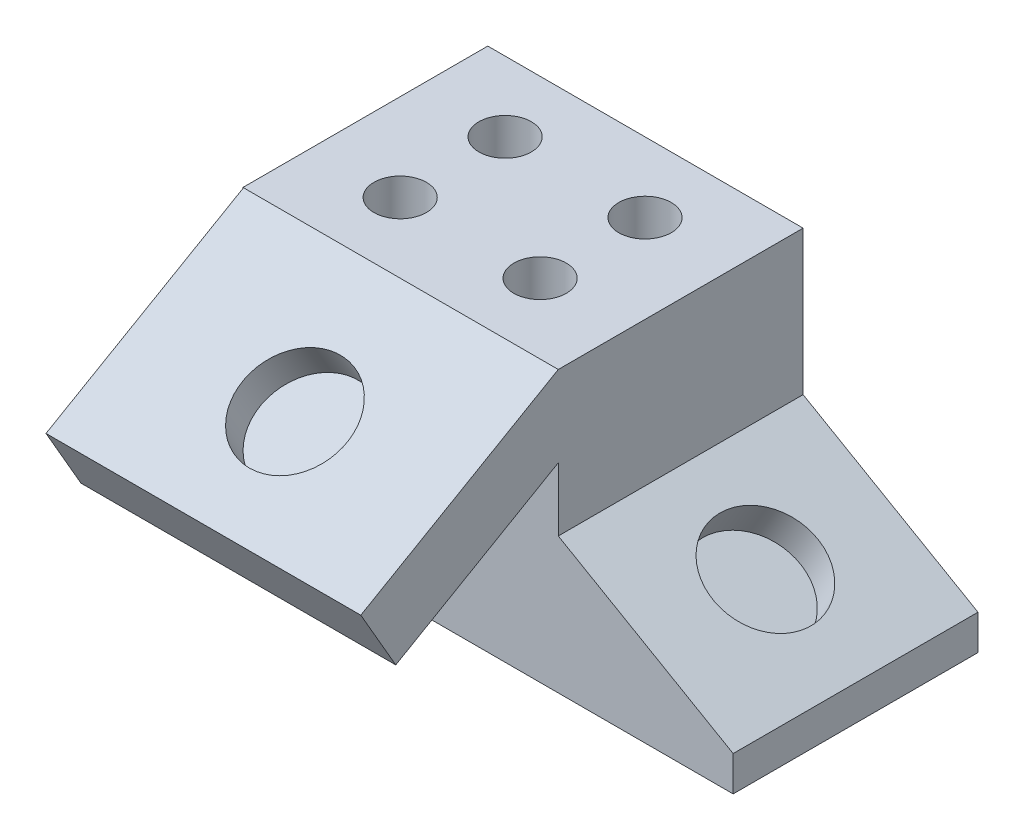
ISO-10303-21;
HEADER;
FILE_DESCRIPTION(('STEP AP214'),'2;1');
FILE_NAME('part.step','',(''),(''),'','','');
FILE_SCHEMA(('AUTOMOTIVE_DESIGN { 1 0 10303 214 1 1 1 1 }'));
ENDSEC;
DATA;
#1=APPLICATION_CONTEXT('core data for automotive mechanical design processes');
#2=APPLICATION_PROTOCOL_DEFINITION('international standard','automotive_design',2000,#1);
#3=PRODUCT_CONTEXT('',#1,'mechanical');
#4=PRODUCT('Part','Part','',(#3));
#5=PRODUCT_RELATED_PRODUCT_CATEGORY('part','',(#4));
#6=PRODUCT_DEFINITION_FORMATION('','',#4);
#7=PRODUCT_DEFINITION_CONTEXT('part definition',#1,'design');
#8=PRODUCT_DEFINITION('design','',#6,#7);
#9=PRODUCT_DEFINITION_SHAPE('','',#8);
#10=(LENGTH_UNIT() NAMED_UNIT(*) SI_UNIT(.MILLI.,.METRE.));
#11=(NAMED_UNIT(*) PLANE_ANGLE_UNIT() SI_UNIT($,.RADIAN.));
#12=(NAMED_UNIT(*) SI_UNIT($,.STERADIAN.) SOLID_ANGLE_UNIT());
#13=UNCERTAINTY_MEASURE_WITH_UNIT(LENGTH_MEASURE(1.E-05),#10,'distance_accuracy_value','');
#14=(GEOMETRIC_REPRESENTATION_CONTEXT(3) GLOBAL_UNCERTAINTY_ASSIGNED_CONTEXT((#13)) GLOBAL_UNIT_ASSIGNED_CONTEXT((#10,
#11,#12)) REPRESENTATION_CONTEXT('',''));
#15=CARTESIAN_POINT('',(0.,0.,0.));
#16=DIRECTION('',(0.,0.,1.));
#17=DIRECTION('',(1.,0.,0.));
#18=AXIS2_PLACEMENT_3D('',#15,#16,#17);
#19=CARTESIAN_POINT('',(0.,0.,44.45));
#20=DIRECTION('',(0.,0.,-1.));
#21=DIRECTION('',(-1.,0.,0.));
#22=AXIS2_PLACEMENT_3D('',#19,#20,#21);
#23=PLANE('',#22);
#24=DIRECTION('',(1.,0.,0.));
#25=VECTOR('',#24,1.);
#26=CARTESIAN_POINT('',(0.0989276974731404,36.1977904066003,44.45));
#27=LINE('',#26,#25);
#28=CARTESIAN_POINT('',(0.0989276974731404,36.1977904066003,44.45));
#29=VERTEX_POINT('',#28);
#30=CARTESIAN_POINT('',(57.2489276974731,36.1977904066003,44.45));
#31=VERTEX_POINT('',#30);
#32=EDGE_CURVE('E138',#29,#31,#27,.T.);
#33=ORIENTED_EDGE('',*,*,#32,.F.);
#34=DIRECTION('',(0.,1.,0.));
#35=VECTOR('',#34,1.);
#36=CARTESIAN_POINT('',(0.0989276974731404,50.8624872440168,44.45));
#37=LINE('',#36,#35);
#38=CARTESIAN_POINT('',(0.0989276974731404,50.8624872440168,44.45));
#39=VERTEX_POINT('',#38);
#40=EDGE_CURVE('E172',#29,#39,#37,.T.);
#41=ORIENTED_EDGE('',*,*,#40,.T.);
#42=DIRECTION('',(-1.,0.,0.));
#43=VECTOR('',#42,1.);
#44=CARTESIAN_POINT('',(0.,50.8624872440168,44.45));
#45=LINE('',#44,#43);
#46=CARTESIAN_POINT('',(0.,50.8624872440168,44.45));
#47=VERTEX_POINT('',#46);
#48=EDGE_CURVE('E126',#39,#47,#45,.T.);
#49=ORIENTED_EDGE('',*,*,#48,.T.);
#50=DIRECTION('',(0.,-1.,0.));
#51=VECTOR('',#50,1.);
#52=CARTESIAN_POINT('',(0.,0.,44.45));
#53=LINE('',#52,#51);
#54=CARTESIAN_POINT('',(0.,0.,44.45));
#55=VERTEX_POINT('',#54);
#56=EDGE_CURVE('E61',#47,#55,#53,.T.);
#57=ORIENTED_EDGE('',*,*,#56,.T.);
#58=DIRECTION('',(1.,0.,0.));
#59=VECTOR('',#58,1.);
#60=CARTESIAN_POINT('',(88.9989276974731,0.,44.45));
#61=LINE('',#60,#59);
#62=CARTESIAN_POINT('',(88.9989276974731,0.,44.45));
#63=VERTEX_POINT('',#62);
#64=EDGE_CURVE('E146',#55,#63,#61,.T.);
#65=ORIENTED_EDGE('',*,*,#64,.T.);
#66=DIRECTION('',(0.,1.,0.));
#67=VECTOR('',#66,1.);
#68=CARTESIAN_POINT('',(88.9989276974731,6.35,44.45));
#69=LINE('',#68,#67);
#70=CARTESIAN_POINT('',(88.9989276974731,6.35,44.45));
#71=VERTEX_POINT('',#70);
#72=EDGE_CURVE('E96',#63,#71,#69,.T.);
#73=ORIENTED_EDGE('',*,*,#72,.T.);
#74=DIRECTION('',(-0.86602540378444,0.499999999999998,0.));
#75=VECTOR('',#74,1.);
#76=CARTESIAN_POINT('',(57.2489276974731,24.6808710467705,44.45));
#77=LINE('',#76,#75);
#78=CARTESIAN_POINT('',(57.2489276974731,24.6808710467705,44.45));
#79=VERTEX_POINT('',#78);
#80=EDGE_CURVE('E104',#71,#79,#77,.T.);
#81=ORIENTED_EDGE('',*,*,#80,.T.);
#82=DIRECTION('',(0.,1.,0.));
#83=VECTOR('',#82,1.);
#84=CARTESIAN_POINT('',(57.2489276974731,50.8624872440168,44.45));
#85=LINE('',#84,#83);
#86=EDGE_CURVE('E108',#79,#31,#85,.T.);
#87=ORIENTED_EDGE('',*,*,#86,.T.);
#88=EDGE_LOOP('',(#33,#41,#49,#57,#65,#73,#81,#87));
#89=FACE_BOUND('',#88,.T.);
#90=ADVANCED_FACE('F37',(#89),#23,.F.);
#91=CARTESIAN_POINT('',(88.9989276974731,0.,44.45));
#92=DIRECTION('',(0.,1.,0.));
#93=DIRECTION('',(-1.,0.,0.));
#94=AXIS2_PLACEMENT_3D('',#91,#92,#93);
#95=PLANE('',#94);
#96=DIRECTION('',(1.,0.,0.));
#97=VECTOR('',#96,1.);
#98=CARTESIAN_POINT('',(88.9989276974731,0.,0.));
#99=LINE('',#98,#97);
#100=CARTESIAN_POINT('',(0.,0.,0.));
#101=VERTEX_POINT('',#100);
#102=CARTESIAN_POINT('',(88.9989276974731,0.,0.));
#103=VERTEX_POINT('',#102);
#104=EDGE_CURVE('E134',#101,#103,#99,.T.);
#105=ORIENTED_EDGE('',*,*,#104,.T.);
#106=DIRECTION('',(0.,0.,-1.));
#107=VECTOR('',#106,1.);
#108=CARTESIAN_POINT('',(88.9989276974731,0.,44.45));
#109=LINE('',#108,#107);
#110=EDGE_CURVE('E11',#63,#103,#109,.T.);
#111=ORIENTED_EDGE('',*,*,#110,.F.);
#112=ORIENTED_EDGE('',*,*,#64,.F.);
#113=DIRECTION('',(0.,0.,-1.));
#114=VECTOR('',#113,1.);
#115=CARTESIAN_POINT('',(0.,0.,44.45));
#116=LINE('',#115,#114);
#117=EDGE_CURVE('E133',#55,#101,#116,.T.);
#118=ORIENTED_EDGE('',*,*,#117,.T.);
#119=EDGE_LOOP('',(#105,#111,#112,#118));
#120=FACE_BOUND('',#119,.T.);
#121=ADVANCED_FACE('F39',(#120),#95,.F.);
#122=CARTESIAN_POINT('',(88.9989276974731,6.35,44.45));
#123=DIRECTION('',(-1.,0.,0.));
#124=DIRECTION('',(0.,0.,1.));
#125=AXIS2_PLACEMENT_3D('',#122,#123,#124);
#126=PLANE('',#125);
#127=DIRECTION('',(0.,1.,0.));
#128=VECTOR('',#127,1.);
#129=CARTESIAN_POINT('',(88.9989276974731,6.35,0.));
#130=LINE('',#129,#128);
#131=CARTESIAN_POINT('',(88.9989276974731,6.35,0.));
#132=VERTEX_POINT('',#131);
#133=EDGE_CURVE('E137',#103,#132,#130,.T.);
#134=ORIENTED_EDGE('',*,*,#133,.T.);
#135=DIRECTION('',(0.,0.,-1.));
#136=VECTOR('',#135,1.);
#137=CARTESIAN_POINT('',(88.9989276974731,6.35,44.45));
#138=LINE('',#137,#136);
#139=EDGE_CURVE('E45',#71,#132,#138,.T.);
#140=ORIENTED_EDGE('',*,*,#139,.F.);
#141=ORIENTED_EDGE('',*,*,#72,.F.);
#142=ORIENTED_EDGE('',*,*,#110,.T.);
#143=EDGE_LOOP('',(#134,#140,#141,#142));
#144=FACE_BOUND('',#143,.T.);
#145=ADVANCED_FACE('F201',(#144),#126,.F.);
#146=CARTESIAN_POINT('',(57.2489276974731,24.6808710467705,44.45));
#147=DIRECTION('',(-0.499999999999998,-0.86602540378444,0.));
#148=DIRECTION('',(0.86602540378444,-0.499999999999998,0.));
#149=AXIS2_PLACEMENT_3D('',#146,#147,#148);
#150=PLANE('',#149);
#151=CARTESIAN_POINT('',(72.5011437553796,15.8749999999999,22.098));
#152=DIRECTION('',(0.499999999999998,0.86602540378444,0.));
#153=DIRECTION('',(-0.86602540378444,0.499999999999998,0.));
#154=AXIS2_PLACEMENT_3D('',#151,#152,#153);
#155=CIRCLE('',#154,9.52500000000002);
#156=CARTESIAN_POINT('',(64.2522517843328,20.6374999999999,22.098));
#157=VERTEX_POINT('',#156);
#158=EDGE_CURVE('E444',#157,#157,#155,.T.);
#159=ORIENTED_EDGE('',*,*,#158,.F.);
#160=EDGE_LOOP('',(#159));
#161=FACE_BOUND('',#160,.T.);
#162=DIRECTION('',(-0.86602540378444,0.499999999999998,0.));
#163=VECTOR('',#162,1.);
#164=CARTESIAN_POINT('',(57.2489276974731,24.6808710467705,0.));
#165=LINE('',#164,#163);
#166=CARTESIAN_POINT('',(57.2489276974731,24.6808710467705,0.));
#167=VERTEX_POINT('',#166);
#168=EDGE_CURVE('E116',#132,#167,#165,.T.);
#169=ORIENTED_EDGE('',*,*,#168,.T.);
#170=DIRECTION('',(0.,0.,-1.));
#171=VECTOR('',#170,1.);
#172=CARTESIAN_POINT('',(57.2489276974731,24.6808710467705,44.45));
#173=LINE('',#172,#171);
#174=EDGE_CURVE('E113',#79,#167,#173,.T.);
#175=ORIENTED_EDGE('',*,*,#174,.F.);
#176=ORIENTED_EDGE('',*,*,#80,.F.);
#177=ORIENTED_EDGE('',*,*,#139,.T.);
#178=EDGE_LOOP('',(#169,#175,#176,#177));
#179=FACE_BOUND('',#178,.T.);
#180=ADVANCED_FACE('F114',(#161,#179),#150,.F.);
#181=CARTESIAN_POINT('',(57.2489276974731,50.8624872440168,44.45));
#182=DIRECTION('',(-1.,0.,0.));
#183=DIRECTION('',(0.,0.,1.));
#184=AXIS2_PLACEMENT_3D('',#181,#182,#183);
#185=PLANE('',#184);
#186=DIRECTION('',(0.,1.,0.));
#187=VECTOR('',#186,1.);
#188=CARTESIAN_POINT('',(57.2489276974731,50.8624872440168,0.));
#189=LINE('',#188,#187);
#190=CARTESIAN_POINT('',(57.2489276974731,50.8624872440168,0.));
#191=VERTEX_POINT('',#190);
#192=EDGE_CURVE('E141',#167,#191,#189,.T.);
#193=ORIENTED_EDGE('',*,*,#192,.T.);
#194=DIRECTION('',(0.,0.,-1.));
#195=VECTOR('',#194,1.);
#196=CARTESIAN_POINT('',(57.2489276974731,50.8624872440168,44.45));
#197=LINE('',#196,#195);
#198=CARTESIAN_POINT('',(57.2489276974731,50.8624872440168,44.45));
#199=VERTEX_POINT('',#198);
#200=EDGE_CURVE('E119',#199,#191,#197,.T.);
#201=ORIENTED_EDGE('',*,*,#200,.F.);
#202=DIRECTION('',(0.,-0.499999999999995,0.866025403784441));
#203=VECTOR('',#202,1.);
#204=CARTESIAN_POINT('',(57.2489276974731,50.8624872440168,44.45));
#205=LINE('',#204,#203);
#206=CARTESIAN_POINT('',(57.2489276974731,30.161487244017,80.3051837674834));
#207=VERTEX_POINT('',#206);
#208=EDGE_CURVE('E171',#199,#207,#205,.T.);
#209=ORIENTED_EDGE('',*,*,#208,.T.);
#210=DIRECTION('',(0.,-0.866025403784441,-0.499999999999995));
#211=VECTOR('',#210,1.);
#212=CARTESIAN_POINT('',(57.2489276974731,30.161487244017,80.3051837674834));
#213=LINE('',#212,#211);
#214=CARTESIAN_POINT('',(57.2489276974731,19.1629646159546,73.9551837674835));
#215=VERTEX_POINT('',#214);
#216=EDGE_CURVE('E179',#207,#215,#213,.T.);
#217=ORIENTED_EDGE('',*,*,#216,.T.);
#218=DIRECTION('',(0.,0.499999999999995,-0.866025403784441));
#219=VECTOR('',#218,1.);
#220=CARTESIAN_POINT('',(57.2489276974731,19.1629646159546,73.9551837674835));
#221=LINE('',#220,#219);
#222=EDGE_CURVE('E125',#215,#31,#221,.T.);
#223=ORIENTED_EDGE('',*,*,#222,.T.);
#224=ORIENTED_EDGE('',*,*,#86,.F.);
#225=ORIENTED_EDGE('',*,*,#174,.T.);
#226=EDGE_LOOP('',(#193,#201,#209,#217,#223,#224,#225));
#227=FACE_BOUND('',#226,.T.);
#228=ADVANCED_FACE('F122',(#227),#185,.F.);
#229=CARTESIAN_POINT('',(0.,50.8624872440168,44.45));
#230=DIRECTION('',(0.,-1.,0.));
#231=DIRECTION('',(0.,0.,-1.));
#232=AXIS2_PLACEMENT_3D('',#229,#230,#231);
#233=PLANE('',#232);
#234=CARTESIAN_POINT('',(41.2469276974731,50.8624872440168,12.7));
#235=DIRECTION('',(0.,1.,0.));
#236=DIRECTION('',(0.,0.,1.));
#237=AXIS2_PLACEMENT_3D('',#234,#235,#236);
#238=CIRCLE('',#237,4.7625);
#239=CARTESIAN_POINT('',(41.2469276974731,50.8624872440168,17.4625));
#240=VERTEX_POINT('',#239);
#241=EDGE_CURVE('E432',#240,#240,#238,.T.);
#242=ORIENTED_EDGE('',*,*,#241,.F.);
#243=EDGE_LOOP('',(#242));
#244=FACE_BOUND('',#243,.T.);
#245=CARTESIAN_POINT('',(41.2469276974731,50.8624872440168,31.75));
#246=DIRECTION('',(0.,1.,0.));
#247=DIRECTION('',(0.,0.,1.));
#248=AXIS2_PLACEMENT_3D('',#245,#246,#247);
#249=CIRCLE('',#248,4.7625);
#250=CARTESIAN_POINT('',(41.2469276974731,50.8624872440168,36.5125));
#251=VERTEX_POINT('',#250);
#252=EDGE_CURVE('E431',#251,#251,#249,.T.);
#253=ORIENTED_EDGE('',*,*,#252,.F.);
#254=EDGE_LOOP('',(#253));
#255=FACE_BOUND('',#254,.T.);
#256=CARTESIAN_POINT('',(15.8469276974731,50.8624872440168,31.75));
#257=DIRECTION('',(0.,1.,0.));
#258=DIRECTION('',(0.,0.,1.));
#259=AXIS2_PLACEMENT_3D('',#256,#257,#258);
#260=CIRCLE('',#259,4.7625);
#261=CARTESIAN_POINT('',(15.8469276974731,50.8624872440168,36.5125));
#262=VERTEX_POINT('',#261);
#263=EDGE_CURVE('E464',#262,#262,#260,.T.);
#264=ORIENTED_EDGE('',*,*,#263,.F.);
#265=EDGE_LOOP('',(#264));
#266=FACE_BOUND('',#265,.T.);
#267=CARTESIAN_POINT('',(15.8469276974731,50.8624872440168,12.7));
#268=DIRECTION('',(0.,1.,0.));
#269=DIRECTION('',(0.,0.,1.));
#270=AXIS2_PLACEMENT_3D('',#267,#268,#269);
#271=CIRCLE('',#270,4.7625);
#272=CARTESIAN_POINT('',(15.8469276974731,50.8624872440168,17.4625));
#273=VERTEX_POINT('',#272);
#274=EDGE_CURVE('E445',#273,#273,#271,.T.);
#275=ORIENTED_EDGE('',*,*,#274,.F.);
#276=EDGE_LOOP('',(#275));
#277=FACE_BOUND('',#276,.T.);
#278=DIRECTION('',(-1.,0.,0.));
#279=VECTOR('',#278,1.);
#280=CARTESIAN_POINT('',(0.,50.8624872440168,0.));
#281=LINE('',#280,#279);
#282=CARTESIAN_POINT('',(0.,50.8624872440168,0.));
#283=VERTEX_POINT('',#282);
#284=EDGE_CURVE('E143',#191,#283,#281,.T.);
#285=ORIENTED_EDGE('',*,*,#284,.T.);
#286=DIRECTION('',(0.,0.,-1.));
#287=VECTOR('',#286,1.);
#288=CARTESIAN_POINT('',(0.,50.8624872440168,44.45));
#289=LINE('',#288,#287);
#290=EDGE_CURVE('E148',#47,#283,#289,.T.);
#291=ORIENTED_EDGE('',*,*,#290,.F.);
#292=ORIENTED_EDGE('',*,*,#48,.F.);
#293=EDGE_CURVE('E128',#199,#39,#45,.T.);
#294=ORIENTED_EDGE('',*,*,#293,.F.);
#295=ORIENTED_EDGE('',*,*,#200,.T.);
#296=EDGE_LOOP('',(#285,#291,#292,#294,#295));
#297=FACE_BOUND('',#296,.T.);
#298=ADVANCED_FACE('F160',(#244,#255,#266,#277,#297),#233,.F.);
#299=CARTESIAN_POINT('',(0.,0.,44.45));
#300=DIRECTION('',(1.,0.,0.));
#301=DIRECTION('',(0.,0.,-1.));
#302=AXIS2_PLACEMENT_3D('',#299,#300,#301);
#303=PLANE('',#302);
#304=DIRECTION('',(0.,-1.,0.));
#305=VECTOR('',#304,1.);
#306=CARTESIAN_POINT('',(0.,0.,0.));
#307=LINE('',#306,#305);
#308=EDGE_CURVE('E88',#283,#101,#307,.T.);
#309=ORIENTED_EDGE('',*,*,#308,.T.);
#310=ORIENTED_EDGE('',*,*,#117,.F.);
#311=ORIENTED_EDGE('',*,*,#56,.F.);
#312=ORIENTED_EDGE('',*,*,#290,.T.);
#313=EDGE_LOOP('',(#309,#310,#311,#312));
#314=FACE_BOUND('',#313,.T.);
#315=ADVANCED_FACE('F219',(#314),#303,.F.);
#316=CARTESIAN_POINT('',(0.,0.,0.));
#317=DIRECTION('',(0.,0.,-1.));
#318=DIRECTION('',(-1.,0.,0.));
#319=AXIS2_PLACEMENT_3D('',#316,#317,#318);
#320=PLANE('',#319);
#321=ORIENTED_EDGE('',*,*,#104,.F.);
#322=ORIENTED_EDGE('',*,*,#308,.F.);
#323=ORIENTED_EDGE('',*,*,#284,.F.);
#324=ORIENTED_EDGE('',*,*,#192,.F.);
#325=ORIENTED_EDGE('',*,*,#168,.F.);
#326=ORIENTED_EDGE('',*,*,#133,.F.);
#327=EDGE_LOOP('',(#321,#322,#323,#324,#325,#326));
#328=FACE_BOUND('',#327,.T.);
#329=ADVANCED_FACE('F153',(#328),#320,.T.);
#330=CARTESIAN_POINT('',(0.0989276974731404,19.1629646159546,73.9551837674835));
#331=DIRECTION('',(0.,-0.866025403784441,-0.499999999999995));
#332=DIRECTION('',(0.,0.499999999999995,-0.866025403784441));
#333=AXIS2_PLACEMENT_3D('',#330,#331,#332);
#334=PLANE('',#333);
#335=ORIENTED_EDGE('',*,*,#222,.F.);
#336=DIRECTION('',(1.,0.,0.));
#337=VECTOR('',#336,1.);
#338=CARTESIAN_POINT('',(0.0989276974731404,19.1629646159546,73.9551837674835));
#339=LINE('',#338,#337);
#340=CARTESIAN_POINT('',(0.0989276974731404,19.1629646159546,73.9551837674835));
#341=VERTEX_POINT('',#340);
#342=EDGE_CURVE('E194',#341,#215,#339,.T.);
#343=ORIENTED_EDGE('',*,*,#342,.F.);
#344=DIRECTION('',(0.,0.499999999999995,-0.866025403784441));
#345=VECTOR('',#344,1.);
#346=CARTESIAN_POINT('',(0.0989276974731404,19.1629646159546,73.9551837674835));
#347=LINE('',#346,#345);
#348=EDGE_CURVE('E187',#341,#29,#347,.T.);
#349=ORIENTED_EDGE('',*,*,#348,.T.);
#350=ORIENTED_EDGE('',*,*,#32,.T.);
#351=EDGE_LOOP('',(#335,#343,#349,#350));
#352=FACE_BOUND('',#351,.T.);
#353=ADVANCED_FACE('F218',(#352),#334,.T.);
#354=CARTESIAN_POINT('',(0.0989276974731404,30.161487244017,80.3051837674834));
#355=DIRECTION('',(0.,-0.499999999999995,0.866025403784441));
#356=DIRECTION('',(0.,-0.866025403784441,-0.499999999999995));
#357=AXIS2_PLACEMENT_3D('',#354,#355,#356);
#358=PLANE('',#357);
#359=ORIENTED_EDGE('',*,*,#216,.F.);
#360=DIRECTION('',(1.,0.,0.));
#361=VECTOR('',#360,1.);
#362=CARTESIAN_POINT('',(0.0989276974731404,30.161487244017,80.3051837674834));
#363=LINE('',#362,#361);
#364=CARTESIAN_POINT('',(0.0989276974731404,30.161487244017,80.3051837674834));
#365=VERTEX_POINT('',#364);
#366=EDGE_CURVE('E189',#365,#207,#363,.T.);
#367=ORIENTED_EDGE('',*,*,#366,.F.);
#368=DIRECTION('',(0.,-0.866025403784441,-0.499999999999995));
#369=VECTOR('',#368,1.);
#370=CARTESIAN_POINT('',(0.0989276974731404,30.161487244017,80.3051837674834));
#371=LINE('',#370,#369);
#372=EDGE_CURVE('E177',#365,#341,#371,.T.);
#373=ORIENTED_EDGE('',*,*,#372,.T.);
#374=ORIENTED_EDGE('',*,*,#342,.T.);
#375=EDGE_LOOP('',(#359,#367,#373,#374));
#376=FACE_BOUND('',#375,.T.);
#377=ADVANCED_FACE('F250',(#376),#358,.T.);
#378=CARTESIAN_POINT('',(0.0989276974731404,50.8624872440168,44.45));
#379=DIRECTION('',(0.,0.866025403784442,0.499999999999995));
#380=DIRECTION('',(0.,-0.499999999999995,0.866025403784442));
#381=AXIS2_PLACEMENT_3D('',#378,#379,#380);
#382=PLANE('',#381);
#383=CARTESIAN_POINT('',(28.8009276974731,39.6864872440169,63.8073998253899));
#384=DIRECTION('',(0.,0.866025403784442,0.499999999999995));
#385=DIRECTION('',(0.,-0.499999999999995,0.866025403784442));
#386=AXIS2_PLACEMENT_3D('',#383,#384,#385);
#387=CIRCLE('',#386,9.525);
#388=CARTESIAN_POINT('',(28.8009276974731,34.9239872440169,72.0562917964367));
#389=VERTEX_POINT('',#388);
#390=EDGE_CURVE('E182',#389,#389,#387,.T.);
#391=ORIENTED_EDGE('',*,*,#390,.F.);
#392=EDGE_LOOP('',(#391));
#393=FACE_BOUND('',#392,.T.);
#394=ORIENTED_EDGE('',*,*,#208,.F.);
#395=ORIENTED_EDGE('',*,*,#293,.T.);
#396=DIRECTION('',(0.,-0.499999999999995,0.866025403784441));
#397=VECTOR('',#396,1.);
#398=CARTESIAN_POINT('',(0.0989276974731404,50.8624872440168,44.45));
#399=LINE('',#398,#397);
#400=EDGE_CURVE('E52',#39,#365,#399,.T.);
#401=ORIENTED_EDGE('',*,*,#400,.T.);
#402=ORIENTED_EDGE('',*,*,#366,.T.);
#403=EDGE_LOOP('',(#394,#395,#401,#402));
#404=FACE_BOUND('',#403,.T.);
#405=ADVANCED_FACE('F168',(#393,#404),#382,.T.);
#406=CARTESIAN_POINT('',(0.0989276974731404,0.,0.));
#407=DIRECTION('',(1.,0.,0.));
#408=DIRECTION('',(0.,0.,-1.));
#409=AXIS2_PLACEMENT_3D('',#406,#407,#408);
#410=PLANE('',#409);
#411=ORIENTED_EDGE('',*,*,#40,.F.);
#412=ORIENTED_EDGE('',*,*,#348,.F.);
#413=ORIENTED_EDGE('',*,*,#372,.F.);
#414=ORIENTED_EDGE('',*,*,#400,.F.);
#415=EDGE_LOOP('',(#411,#412,#413,#414));
#416=FACE_BOUND('',#415,.T.);
#417=ADVANCED_FACE('F265',(#416),#410,.F.);
#418=CARTESIAN_POINT('',(28.8009276974731,34.1872259299857,60.6323998253899));
#419=DIRECTION('',(0.,0.866025403784442,0.499999999999995));
#420=DIRECTION('',(0.,-0.499999999999995,0.866025403784442));
#421=AXIS2_PLACEMENT_3D('',#418,#419,#420);
#422=CYLINDRICAL_SURFACE('',#421,9.525);
#423=CARTESIAN_POINT('',(28.8009276974731,34.1872259299857,60.6323998253899));
#424=DIRECTION('',(0.,0.866025403784442,0.499999999999995));
#425=DIRECTION('',(0.,-0.499999999999995,0.866025403784442));
#426=AXIS2_PLACEMENT_3D('',#423,#424,#425);
#427=CIRCLE('',#426,9.525);
#428=CARTESIAN_POINT('',(28.8009276974731,29.4247259299857,68.8812917964367));
#429=VERTEX_POINT('',#428);
#430=EDGE_CURVE('E191',#429,#429,#427,.T.);
#431=ORIENTED_EDGE('',*,*,#430,.F.);
#432=EDGE_LOOP('',(#431));
#433=FACE_BOUND('',#432,.T.);
#434=ORIENTED_EDGE('',*,*,#390,.T.);
#435=EDGE_LOOP('',(#434));
#436=FACE_BOUND('',#435,.T.);
#437=ADVANCED_FACE('F272',(#433,#436),#422,.F.);
#438=CARTESIAN_POINT('',(28.8009276974731,34.1872259299857,60.6323998253899));
#439=DIRECTION('',(0.,0.866025403784442,0.499999999999995));
#440=DIRECTION('',(0.,-0.499999999999995,0.866025403784442));
#441=AXIS2_PLACEMENT_3D('',#438,#439,#440);
#442=PLANE('',#441);
#443=ORIENTED_EDGE('',*,*,#430,.T.);
#444=EDGE_LOOP('',(#443));
#445=FACE_BOUND('',#444,.T.);
#446=ADVANCED_FACE('F278',(#445),#442,.T.);
#447=CARTESIAN_POINT('',(69.3261437553796,10.3757386859688,22.098));
#448=DIRECTION('',(0.499999999999998,0.86602540378444,0.));
#449=DIRECTION('',(-0.86602540378444,0.499999999999998,0.));
#450=AXIS2_PLACEMENT_3D('',#447,#448,#449);
#451=CYLINDRICAL_SURFACE('',#450,9.52500000000002);
#452=CARTESIAN_POINT('',(69.3261437553796,10.3757386859688,22.098));
#453=DIRECTION('',(0.499999999999998,0.86602540378444,0.));
#454=DIRECTION('',(-0.86602540378444,0.499999999999998,0.));
#455=AXIS2_PLACEMENT_3D('',#452,#453,#454);
#456=CIRCLE('',#455,9.52500000000002);
#457=CARTESIAN_POINT('',(61.0772517843328,15.1382386859687,22.098));
#458=VERTEX_POINT('',#457);
#459=EDGE_CURVE('E449',#458,#458,#456,.T.);
#460=ORIENTED_EDGE('',*,*,#459,.F.);
#461=EDGE_LOOP('',(#460));
#462=FACE_BOUND('',#461,.T.);
#463=ORIENTED_EDGE('',*,*,#158,.T.);
#464=EDGE_LOOP('',(#463));
#465=FACE_BOUND('',#464,.T.);
#466=ADVANCED_FACE('F286',(#462,#465),#451,.F.);
#467=CARTESIAN_POINT('',(69.3261437553796,10.3757386859688,22.098));
#468=DIRECTION('',(0.499999999999998,0.86602540378444,0.));
#469=DIRECTION('',(-0.86602540378444,0.499999999999998,0.));
#470=AXIS2_PLACEMENT_3D('',#467,#468,#469);
#471=PLANE('',#470);
#472=ORIENTED_EDGE('',*,*,#459,.T.);
#473=EDGE_LOOP('',(#472));
#474=FACE_BOUND('',#473,.T.);
#475=ADVANCED_FACE('F294',(#474),#471,.T.);
#476=CARTESIAN_POINT('',(15.8469276974731,38.1624872440168,12.7));
#477=DIRECTION('',(0.,1.,0.));
#478=DIRECTION('',(0.,0.,1.));
#479=AXIS2_PLACEMENT_3D('',#476,#477,#478);
#480=CYLINDRICAL_SURFACE('',#479,4.7625);
#481=CARTESIAN_POINT('',(15.8469276974731,38.1624872440168,12.7));
#482=DIRECTION('',(0.,1.,0.));
#483=DIRECTION('',(0.,0.,1.));
#484=AXIS2_PLACEMENT_3D('',#481,#482,#483);
#485=CIRCLE('',#484,4.7625);
#486=CARTESIAN_POINT('',(15.8469276974731,38.1624872440168,17.4625));
#487=VERTEX_POINT('',#486);
#488=EDGE_CURVE('E441',#487,#487,#485,.T.);
#489=ORIENTED_EDGE('',*,*,#488,.F.);
#490=EDGE_LOOP('',(#489));
#491=FACE_BOUND('',#490,.T.);
#492=ORIENTED_EDGE('',*,*,#274,.T.);
#493=EDGE_LOOP('',(#492));
#494=FACE_BOUND('',#493,.T.);
#495=ADVANCED_FACE('F301',(#491,#494),#480,.F.);
#496=CARTESIAN_POINT('',(15.8469276974731,38.1624872440168,12.7));
#497=DIRECTION('',(0.,1.,0.));
#498=DIRECTION('',(0.,0.,1.));
#499=AXIS2_PLACEMENT_3D('',#496,#497,#498);
#500=PLANE('',#499);
#501=ORIENTED_EDGE('',*,*,#488,.T.);
#502=EDGE_LOOP('',(#501));
#503=FACE_BOUND('',#502,.T.);
#504=ADVANCED_FACE('F308',(#503),#500,.T.);
#505=CARTESIAN_POINT('',(15.8469276974731,38.1624872440168,31.75));
#506=DIRECTION('',(0.,1.,0.));
#507=DIRECTION('',(0.,0.,1.));
#508=AXIS2_PLACEMENT_3D('',#505,#506,#507);
#509=CYLINDRICAL_SURFACE('',#508,4.7625);
#510=CARTESIAN_POINT('',(15.8469276974731,38.1624872440168,31.75));
#511=DIRECTION('',(0.,1.,0.));
#512=DIRECTION('',(0.,0.,1.));
#513=AXIS2_PLACEMENT_3D('',#510,#511,#512);
#514=CIRCLE('',#513,4.7625);
#515=CARTESIAN_POINT('',(15.8469276974731,38.1624872440168,36.5125));
#516=VERTEX_POINT('',#515);
#517=EDGE_CURVE('E448',#516,#516,#514,.T.);
#518=ORIENTED_EDGE('',*,*,#517,.F.);
#519=EDGE_LOOP('',(#518));
#520=FACE_BOUND('',#519,.T.);
#521=ORIENTED_EDGE('',*,*,#263,.T.);
#522=EDGE_LOOP('',(#521));
#523=FACE_BOUND('',#522,.T.);
#524=ADVANCED_FACE('F316',(#520,#523),#509,.F.);
#525=CARTESIAN_POINT('',(15.8469276974731,38.1624872440168,31.75));
#526=DIRECTION('',(0.,1.,0.));
#527=DIRECTION('',(0.,0.,1.));
#528=AXIS2_PLACEMENT_3D('',#525,#526,#527);
#529=PLANE('',#528);
#530=ORIENTED_EDGE('',*,*,#517,.T.);
#531=EDGE_LOOP('',(#530));
#532=FACE_BOUND('',#531,.T.);
#533=ADVANCED_FACE('F324',(#532),#529,.T.);
#534=CARTESIAN_POINT('',(41.2469276974731,38.1624872440168,31.75));
#535=DIRECTION('',(0.,1.,0.));
#536=DIRECTION('',(0.,0.,1.));
#537=AXIS2_PLACEMENT_3D('',#534,#535,#536);
#538=CYLINDRICAL_SURFACE('',#537,4.7625);
#539=CARTESIAN_POINT('',(41.2469276974731,38.1624872440168,31.75));
#540=DIRECTION('',(0.,1.,0.));
#541=DIRECTION('',(0.,0.,1.));
#542=AXIS2_PLACEMENT_3D('',#539,#540,#541);
#543=CIRCLE('',#542,4.7625);
#544=CARTESIAN_POINT('',(41.2469276974731,38.1624872440168,36.5125));
#545=VERTEX_POINT('',#544);
#546=EDGE_CURVE('E435',#545,#545,#543,.T.);
#547=ORIENTED_EDGE('',*,*,#546,.F.);
#548=EDGE_LOOP('',(#547));
#549=FACE_BOUND('',#548,.T.);
#550=ORIENTED_EDGE('',*,*,#252,.T.);
#551=EDGE_LOOP('',(#550));
#552=FACE_BOUND('',#551,.T.);
#553=ADVANCED_FACE('F332',(#549,#552),#538,.F.);
#554=CARTESIAN_POINT('',(41.2469276974731,38.1624872440168,31.75));
#555=DIRECTION('',(0.,1.,0.));
#556=DIRECTION('',(0.,0.,1.));
#557=AXIS2_PLACEMENT_3D('',#554,#555,#556);
#558=PLANE('',#557);
#559=ORIENTED_EDGE('',*,*,#546,.T.);
#560=EDGE_LOOP('',(#559));
#561=FACE_BOUND('',#560,.T.);
#562=ADVANCED_FACE('F340',(#561),#558,.T.);
#563=CARTESIAN_POINT('',(41.2469276974731,38.1624872440168,12.7));
#564=DIRECTION('',(0.,1.,0.));
#565=DIRECTION('',(0.,0.,1.));
#566=AXIS2_PLACEMENT_3D('',#563,#564,#565);
#567=CYLINDRICAL_SURFACE('',#566,4.7625);
#568=CARTESIAN_POINT('',(41.2469276974731,38.1624872440168,12.7));
#569=DIRECTION('',(0.,1.,0.));
#570=DIRECTION('',(0.,0.,1.));
#571=AXIS2_PLACEMENT_3D('',#568,#569,#570);
#572=CIRCLE('',#571,4.7625);
#573=CARTESIAN_POINT('',(41.2469276974731,38.1624872440168,17.4625));
#574=VERTEX_POINT('',#573);
#575=EDGE_CURVE('E430',#574,#574,#572,.T.);
#576=ORIENTED_EDGE('',*,*,#575,.F.);
#577=EDGE_LOOP('',(#576));
#578=FACE_BOUND('',#577,.T.);
#579=ORIENTED_EDGE('',*,*,#241,.T.);
#580=EDGE_LOOP('',(#579));
#581=FACE_BOUND('',#580,.T.);
#582=ADVANCED_FACE('F348',(#578,#581),#567,.F.);
#583=CARTESIAN_POINT('',(41.2469276974731,38.1624872440168,12.7));
#584=DIRECTION('',(0.,1.,0.));
#585=DIRECTION('',(0.,0.,1.));
#586=AXIS2_PLACEMENT_3D('',#583,#584,#585);
#587=PLANE('',#586);
#588=ORIENTED_EDGE('',*,*,#575,.T.);
#589=EDGE_LOOP('',(#588));
#590=FACE_BOUND('',#589,.T.);
#591=ADVANCED_FACE('F356',(#590),#587,.T.);
#592=CLOSED_SHELL('',(#90,#121,#145,#180,#228,#298,#315,#329,#353,#377,#405,#417,#437,#446,#466,
#475,#495,#504,#524,#533,#553,#562,#582,#591));
#593=MANIFOLD_SOLID_BREP('B2',#592);
#594=ADVANCED_BREP_SHAPE_REPRESENTATION('',(#18,#593),#14);
#595=SHAPE_DEFINITION_REPRESENTATION(#9,#594);
ENDSEC;
END-ISO-10303-21;
